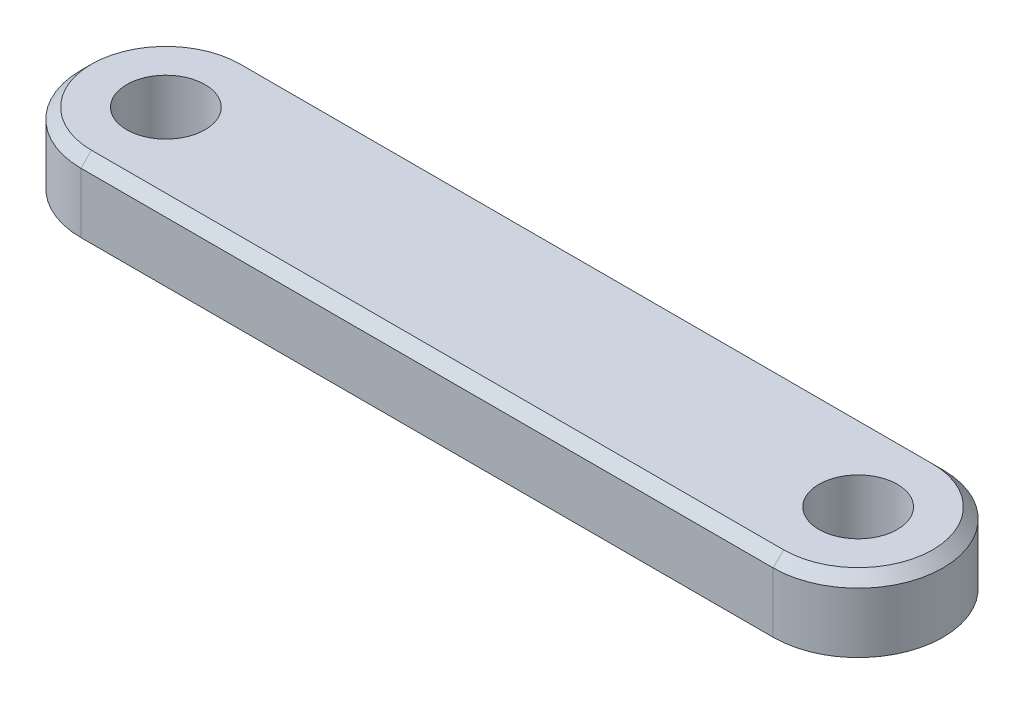
ISO-10303-21;
HEADER;
FILE_DESCRIPTION(('STEP AP214'),'2;1');
FILE_NAME('part.step','',(''),(''),'','','');
FILE_SCHEMA(('AUTOMOTIVE_DESIGN { 1 0 10303 214 1 1 1 1 }'));
ENDSEC;
DATA;
#1=APPLICATION_CONTEXT('core data for automotive mechanical design processes');
#2=APPLICATION_PROTOCOL_DEFINITION('international standard','automotive_design',2000,#1);
#3=PRODUCT_CONTEXT('',#1,'mechanical');
#4=PRODUCT('Part','Part','',(#3));
#5=PRODUCT_RELATED_PRODUCT_CATEGORY('part','',(#4));
#6=PRODUCT_DEFINITION_FORMATION('','',#4);
#7=PRODUCT_DEFINITION_CONTEXT('part definition',#1,'design');
#8=PRODUCT_DEFINITION('design','',#6,#7);
#9=PRODUCT_DEFINITION_SHAPE('','',#8);
#10=(LENGTH_UNIT() NAMED_UNIT(*) SI_UNIT(.MILLI.,.METRE.));
#11=(NAMED_UNIT(*) PLANE_ANGLE_UNIT() SI_UNIT($,.RADIAN.));
#12=(NAMED_UNIT(*) SI_UNIT($,.STERADIAN.) SOLID_ANGLE_UNIT());
#13=UNCERTAINTY_MEASURE_WITH_UNIT(LENGTH_MEASURE(1.E-05),#10,'distance_accuracy_value','');
#14=(GEOMETRIC_REPRESENTATION_CONTEXT(3) GLOBAL_UNCERTAINTY_ASSIGNED_CONTEXT((#13)) GLOBAL_UNIT_ASSIGNED_CONTEXT((#10,
#11,#12)) REPRESENTATION_CONTEXT('',''));
#15=CARTESIAN_POINT('',(0.,0.,0.));
#16=DIRECTION('',(0.,0.,1.));
#17=DIRECTION('',(1.,0.,0.));
#18=AXIS2_PLACEMENT_3D('',#15,#16,#17);
#19=CARTESIAN_POINT('',(-13.25,1.35,0.));
#20=DIRECTION('',(0.,1.,0.));
#21=DIRECTION('',(0.,0.,1.));
#22=AXIS2_PLACEMENT_3D('',#19,#20,#21);
#23=PLANE('',#22);
#24=DIRECTION('',(1.,0.,0.));
#25=VECTOR('',#24,1.);
#26=CARTESIAN_POINT('',(13.25,1.35,2.85));
#27=LINE('',#26,#25);
#28=CARTESIAN_POINT('',(-13.25,1.35,2.85));
#29=VERTEX_POINT('',#28);
#30=CARTESIAN_POINT('',(13.25,1.35,2.85));
#31=VERTEX_POINT('',#30);
#32=EDGE_CURVE('E105',#29,#31,#27,.T.);
#33=ORIENTED_EDGE('',*,*,#32,.T.);
#34=CARTESIAN_POINT('',(13.25,1.35,0.));
#35=DIRECTION('',(0.,1.,0.));
#36=DIRECTION('',(0.,0.,1.));
#37=AXIS2_PLACEMENT_3D('',#34,#35,#36);
#38=CIRCLE('',#37,2.85);
#39=CARTESIAN_POINT('',(13.25,1.35,-2.85));
#40=VERTEX_POINT('',#39);
#41=EDGE_CURVE('E150',#31,#40,#38,.T.);
#42=ORIENTED_EDGE('',*,*,#41,.T.);
#43=DIRECTION('',(-1.,0.,0.));
#44=VECTOR('',#43,1.);
#45=CARTESIAN_POINT('',(-13.25,1.35,-2.85));
#46=LINE('',#45,#44);
#47=CARTESIAN_POINT('',(-13.25,1.35,-2.85));
#48=VERTEX_POINT('',#47);
#49=EDGE_CURVE('E147',#40,#48,#46,.T.);
#50=ORIENTED_EDGE('',*,*,#49,.T.);
#51=CARTESIAN_POINT('',(-13.25,1.35,0.));
#52=DIRECTION('',(0.,1.,0.));
#53=DIRECTION('',(0.,0.,1.));
#54=AXIS2_PLACEMENT_3D('',#51,#52,#53);
#55=CIRCLE('',#54,2.85);
#56=EDGE_CURVE('E144',#48,#29,#55,.T.);
#57=ORIENTED_EDGE('',*,*,#56,.T.);
#58=EDGE_LOOP('',(#33,#42,#50,#57));
#59=FACE_BOUND('',#58,.T.);
#60=CARTESIAN_POINT('',(-13.25,1.35,0.));
#61=DIRECTION('',(0.,1.,0.));
#62=DIRECTION('',(0.,0.,1.));
#63=AXIS2_PLACEMENT_3D('',#60,#61,#62);
#64=CIRCLE('',#63,1.5);
#65=CARTESIAN_POINT('',(-13.25,1.35,1.50000000000001));
#66=VERTEX_POINT('',#65);
#67=EDGE_CURVE('E122',#66,#66,#64,.T.);
#68=ORIENTED_EDGE('',*,*,#67,.F.);
#69=EDGE_LOOP('',(#68));
#70=FACE_BOUND('',#69,.T.);
#71=CARTESIAN_POINT('',(13.25,1.35,0.));
#72=DIRECTION('',(0.,1.,0.));
#73=DIRECTION('',(0.,0.,-1.));
#74=AXIS2_PLACEMENT_3D('',#71,#72,#73);
#75=CIRCLE('',#74,1.5);
#76=CARTESIAN_POINT('',(13.25,1.35,-1.5));
#77=VERTEX_POINT('',#76);
#78=EDGE_CURVE('E183',#77,#77,#75,.T.);
#79=ORIENTED_EDGE('',*,*,#78,.F.);
#80=EDGE_LOOP('',(#79));
#81=FACE_BOUND('',#80,.T.);
#82=ADVANCED_FACE('F45',(#59,#70,#81),#23,.T.);
#83=CARTESIAN_POINT('',(-13.25,-1.35,0.));
#84=DIRECTION('',(0.,1.,0.));
#85=DIRECTION('',(0.,0.,1.));
#86=AXIS2_PLACEMENT_3D('',#83,#84,#85);
#87=PLANE('',#86);
#88=CARTESIAN_POINT('',(-13.25,-1.35,0.));
#89=DIRECTION('',(0.,1.,0.));
#90=DIRECTION('',(0.,0.,1.));
#91=AXIS2_PLACEMENT_3D('',#88,#89,#90);
#92=CIRCLE('',#91,3.25);
#93=CARTESIAN_POINT('',(-13.25,-1.35,-3.25));
#94=VERTEX_POINT('',#93);
#95=CARTESIAN_POINT('',(-13.25,-1.35,3.25));
#96=VERTEX_POINT('',#95);
#97=EDGE_CURVE('E113',#94,#96,#92,.T.);
#98=ORIENTED_EDGE('',*,*,#97,.F.);
#99=DIRECTION('',(-1.,0.,0.));
#100=VECTOR('',#99,1.);
#101=CARTESIAN_POINT('',(-13.25,-1.35,-3.25));
#102=LINE('',#101,#100);
#103=CARTESIAN_POINT('',(13.25,-1.35,-3.25000000000001));
#104=VERTEX_POINT('',#103);
#105=EDGE_CURVE('E132',#104,#94,#102,.T.);
#106=ORIENTED_EDGE('',*,*,#105,.F.);
#107=CARTESIAN_POINT('',(13.25,-1.35,0.));
#108=DIRECTION('',(0.,1.,0.));
#109=DIRECTION('',(0.,0.,1.));
#110=AXIS2_PLACEMENT_3D('',#107,#108,#109);
#111=CIRCLE('',#110,3.25);
#112=CARTESIAN_POINT('',(13.25,-1.35,3.25));
#113=VERTEX_POINT('',#112);
#114=EDGE_CURVE('E115',#113,#104,#111,.T.);
#115=ORIENTED_EDGE('',*,*,#114,.F.);
#116=DIRECTION('',(1.,0.,0.));
#117=VECTOR('',#116,1.);
#118=CARTESIAN_POINT('',(-13.25,-1.35,3.25));
#119=LINE('',#118,#117);
#120=EDGE_CURVE('E101',#96,#113,#119,.T.);
#121=ORIENTED_EDGE('',*,*,#120,.F.);
#122=EDGE_LOOP('',(#98,#106,#115,#121));
#123=FACE_BOUND('',#122,.T.);
#124=CARTESIAN_POINT('',(-13.25,-1.35,0.));
#125=DIRECTION('',(0.,1.,0.));
#126=DIRECTION('',(0.,0.,1.));
#127=AXIS2_PLACEMENT_3D('',#124,#125,#126);
#128=CIRCLE('',#127,1.5);
#129=CARTESIAN_POINT('',(-13.25,-1.35,1.50000000000001));
#130=VERTEX_POINT('',#129);
#131=EDGE_CURVE('E126',#130,#130,#128,.T.);
#132=ORIENTED_EDGE('',*,*,#131,.T.);
#133=EDGE_LOOP('',(#132));
#134=FACE_BOUND('',#133,.T.);
#135=CARTESIAN_POINT('',(13.25,-1.35,0.));
#136=DIRECTION('',(0.,1.,0.));
#137=DIRECTION('',(0.,0.,-1.));
#138=AXIS2_PLACEMENT_3D('',#135,#136,#137);
#139=CIRCLE('',#138,1.5);
#140=CARTESIAN_POINT('',(13.25,-1.35,-1.5));
#141=VERTEX_POINT('',#140);
#142=EDGE_CURVE('E177',#141,#141,#139,.T.);
#143=ORIENTED_EDGE('',*,*,#142,.T.);
#144=EDGE_LOOP('',(#143));
#145=FACE_BOUND('',#144,.T.);
#146=ADVANCED_FACE('F110',(#123,#134,#145),#87,.F.);
#147=CARTESIAN_POINT('',(-13.25,1.35,0.));
#148=DIRECTION('',(0.,-1.,0.));
#149=DIRECTION('',(0.,0.,-1.));
#150=AXIS2_PLACEMENT_3D('',#147,#148,#149);
#151=CYLINDRICAL_SURFACE('',#150,3.25);
#152=DIRECTION('',(0.,-1.,0.));
#153=VECTOR('',#152,1.);
#154=CARTESIAN_POINT('',(-13.25,1.35,3.25));
#155=LINE('',#154,#153);
#156=CARTESIAN_POINT('',(-13.25,0.949999999999996,3.25));
#157=VERTEX_POINT('',#156);
#158=EDGE_CURVE('E98',#157,#96,#155,.T.);
#159=ORIENTED_EDGE('',*,*,#158,.F.);
#160=CARTESIAN_POINT('',(-13.25,0.949999999999996,0.));
#161=DIRECTION('',(0.,1.,0.));
#162=DIRECTION('',(0.,0.,1.));
#163=AXIS2_PLACEMENT_3D('',#160,#161,#162);
#164=CIRCLE('',#163,3.25);
#165=CARTESIAN_POINT('',(-13.25,0.949999999999996,-3.25));
#166=VERTEX_POINT('',#165);
#167=EDGE_CURVE('E56',#157,#166,#164,.F.);
#168=ORIENTED_EDGE('',*,*,#167,.T.);
#169=DIRECTION('',(0.,-1.,0.));
#170=VECTOR('',#169,1.);
#171=CARTESIAN_POINT('',(-13.25,1.35,-3.25));
#172=LINE('',#171,#170);
#173=EDGE_CURVE('E119',#166,#94,#172,.T.);
#174=ORIENTED_EDGE('',*,*,#173,.T.);
#175=ORIENTED_EDGE('',*,*,#97,.T.);
#176=EDGE_LOOP('',(#159,#168,#174,#175));
#177=FACE_BOUND('',#176,.T.);
#178=ADVANCED_FACE('F118',(#177),#151,.T.);
#179=CARTESIAN_POINT('',(-13.25,1.35,3.25));
#180=DIRECTION('',(0.,0.,-1.));
#181=DIRECTION('',(-1.,0.,0.));
#182=AXIS2_PLACEMENT_3D('',#179,#180,#181);
#183=PLANE('',#182);
#184=DIRECTION('',(0.,-1.,0.));
#185=VECTOR('',#184,1.);
#186=CARTESIAN_POINT('',(13.25,1.35,3.25));
#187=LINE('',#186,#185);
#188=CARTESIAN_POINT('',(13.25,0.949999999999996,3.25));
#189=VERTEX_POINT('',#188);
#190=EDGE_CURVE('E106',#189,#113,#187,.T.);
#191=ORIENTED_EDGE('',*,*,#190,.F.);
#192=DIRECTION('',(-1.,0.,0.));
#193=VECTOR('',#192,1.);
#194=CARTESIAN_POINT('',(-13.25,0.949999999999996,3.25));
#195=LINE('',#194,#193);
#196=EDGE_CURVE('E11',#189,#157,#195,.T.);
#197=ORIENTED_EDGE('',*,*,#196,.T.);
#198=ORIENTED_EDGE('',*,*,#158,.T.);
#199=ORIENTED_EDGE('',*,*,#120,.T.);
#200=EDGE_LOOP('',(#191,#197,#198,#199));
#201=FACE_BOUND('',#200,.T.);
#202=ADVANCED_FACE('F100',(#201),#183,.F.);
#203=CARTESIAN_POINT('',(13.25,1.35,0.));
#204=DIRECTION('',(0.,-1.,0.));
#205=DIRECTION('',(0.,0.,-1.));
#206=AXIS2_PLACEMENT_3D('',#203,#204,#205);
#207=CYLINDRICAL_SURFACE('',#206,3.25);
#208=DIRECTION('',(0.,-1.,0.));
#209=VECTOR('',#208,1.);
#210=CARTESIAN_POINT('',(13.25,1.35,-3.25000000000001));
#211=LINE('',#210,#209);
#212=CARTESIAN_POINT('',(13.25,0.949999999999996,-3.25000000000001));
#213=VERTEX_POINT('',#212);
#214=EDGE_CURVE('E137',#213,#104,#211,.T.);
#215=ORIENTED_EDGE('',*,*,#214,.F.);
#216=CARTESIAN_POINT('',(13.25,0.949999999999996,0.));
#217=DIRECTION('',(0.,1.,0.));
#218=DIRECTION('',(0.,0.,1.));
#219=AXIS2_PLACEMENT_3D('',#216,#217,#218);
#220=CIRCLE('',#219,3.25);
#221=EDGE_CURVE('E154',#213,#189,#220,.F.);
#222=ORIENTED_EDGE('',*,*,#221,.T.);
#223=ORIENTED_EDGE('',*,*,#190,.T.);
#224=ORIENTED_EDGE('',*,*,#114,.T.);
#225=EDGE_LOOP('',(#215,#222,#223,#224));
#226=FACE_BOUND('',#225,.T.);
#227=ADVANCED_FACE('F207',(#226),#207,.T.);
#228=CARTESIAN_POINT('',(-13.25,1.35,-3.25));
#229=DIRECTION('',(0.,0.,1.));
#230=DIRECTION('',(1.,0.,0.));
#231=AXIS2_PLACEMENT_3D('',#228,#229,#230);
#232=PLANE('',#231);
#233=ORIENTED_EDGE('',*,*,#173,.F.);
#234=DIRECTION('',(1.,0.,0.));
#235=VECTOR('',#234,1.);
#236=CARTESIAN_POINT('',(13.25,0.949999999999996,-3.25000000000001));
#237=LINE('',#236,#235);
#238=EDGE_CURVE('E158',#166,#213,#237,.T.);
#239=ORIENTED_EDGE('',*,*,#238,.T.);
#240=ORIENTED_EDGE('',*,*,#214,.T.);
#241=ORIENTED_EDGE('',*,*,#105,.T.);
#242=EDGE_LOOP('',(#233,#239,#240,#241));
#243=FACE_BOUND('',#242,.T.);
#244=ADVANCED_FACE('F199',(#243),#232,.F.);
#245=CARTESIAN_POINT('',(-13.25,1.35,0.));
#246=DIRECTION('',(0.,-1.,0.));
#247=DIRECTION('',(0.,0.,-1.));
#248=AXIS2_PLACEMENT_3D('',#245,#246,#247);
#249=CYLINDRICAL_SURFACE('',#248,1.5);
#250=ORIENTED_EDGE('',*,*,#67,.T.);
#251=EDGE_LOOP('',(#250));
#252=FACE_BOUND('',#251,.T.);
#253=ORIENTED_EDGE('',*,*,#131,.F.);
#254=EDGE_LOOP('',(#253));
#255=FACE_BOUND('',#254,.T.);
#256=ADVANCED_FACE('F196',(#252,#255),#249,.F.);
#257=CARTESIAN_POINT('',(13.25,1.35,0.));
#258=DIRECTION('',(0.,-1.,0.));
#259=DIRECTION('',(0.,0.,-1.));
#260=AXIS2_PLACEMENT_3D('',#257,#258,#259);
#261=CYLINDRICAL_SURFACE('',#260,1.5);
#262=ORIENTED_EDGE('',*,*,#78,.T.);
#263=EDGE_LOOP('',(#262));
#264=FACE_BOUND('',#263,.T.);
#265=ORIENTED_EDGE('',*,*,#142,.F.);
#266=EDGE_LOOP('',(#265));
#267=FACE_BOUND('',#266,.T.);
#268=ADVANCED_FACE('F198',(#264,#267),#261,.F.);
#269=CARTESIAN_POINT('',(-13.25,1.35,0.));
#270=DIRECTION('',(0.,-1.,0.));
#271=DIRECTION('',(0.,0.,-1.));
#272=AXIS2_PLACEMENT_3D('',#269,#270,#271);
#273=CONICAL_SURFACE('',#272,2.85,0.785398163397448);
#274=DIRECTION('',(0.,0.707106781186547,0.707106781186547));
#275=VECTOR('',#274,1.);
#276=CARTESIAN_POINT('',(-13.25,0.949999999999996,-3.25));
#277=LINE('',#276,#275);
#278=EDGE_CURVE('E168',#166,#48,#277,.T.);
#279=ORIENTED_EDGE('',*,*,#278,.F.);
#280=ORIENTED_EDGE('',*,*,#167,.F.);
#281=DIRECTION('',(0.,-0.707106781186547,0.707106781186547));
#282=VECTOR('',#281,1.);
#283=CARTESIAN_POINT('',(-13.25,1.35,2.85000000000001));
#284=LINE('',#283,#282);
#285=EDGE_CURVE('E50',#29,#157,#284,.T.);
#286=ORIENTED_EDGE('',*,*,#285,.F.);
#287=ORIENTED_EDGE('',*,*,#56,.F.);
#288=EDGE_LOOP('',(#279,#280,#286,#287));
#289=FACE_BOUND('',#288,.T.);
#290=ADVANCED_FACE('F48',(#289),#273,.T.);
#291=CARTESIAN_POINT('',(-13.25,1.35,2.85));
#292=DIRECTION('',(0.,0.707106781186547,0.707106781186547));
#293=DIRECTION('',(-1.,0.,0.));
#294=AXIS2_PLACEMENT_3D('',#291,#292,#293);
#295=PLANE('',#294);
#296=ORIENTED_EDGE('',*,*,#285,.T.);
#297=ORIENTED_EDGE('',*,*,#196,.F.);
#298=DIRECTION('',(0.,-0.707106781186547,0.707106781186547));
#299=VECTOR('',#298,1.);
#300=CARTESIAN_POINT('',(13.25,1.35,2.85));
#301=LINE('',#300,#299);
#302=EDGE_CURVE('E166',#31,#189,#301,.T.);
#303=ORIENTED_EDGE('',*,*,#302,.F.);
#304=ORIENTED_EDGE('',*,*,#32,.F.);
#305=EDGE_LOOP('',(#296,#297,#303,#304));
#306=FACE_BOUND('',#305,.T.);
#307=ADVANCED_FACE('F239',(#306),#295,.T.);
#308=CARTESIAN_POINT('',(-13.25,1.35,-2.85));
#309=DIRECTION('',(0.,0.707106781186547,-0.707106781186547));
#310=DIRECTION('',(1.,0.,0.));
#311=AXIS2_PLACEMENT_3D('',#308,#309,#310);
#312=PLANE('',#311);
#313=ORIENTED_EDGE('',*,*,#278,.T.);
#314=ORIENTED_EDGE('',*,*,#49,.F.);
#315=DIRECTION('',(0.,0.707106781186547,0.707106781186547));
#316=VECTOR('',#315,1.);
#317=CARTESIAN_POINT('',(13.25,0.949999999999996,-3.25000000000001));
#318=LINE('',#317,#316);
#319=EDGE_CURVE('E163',#213,#40,#318,.T.);
#320=ORIENTED_EDGE('',*,*,#319,.F.);
#321=ORIENTED_EDGE('',*,*,#238,.F.);
#322=EDGE_LOOP('',(#313,#314,#320,#321));
#323=FACE_BOUND('',#322,.T.);
#324=ADVANCED_FACE('F233',(#323),#312,.T.);
#325=CARTESIAN_POINT('',(13.25,1.35,0.));
#326=DIRECTION('',(0.,-1.,0.));
#327=DIRECTION('',(0.,0.,-1.));
#328=AXIS2_PLACEMENT_3D('',#325,#326,#327);
#329=CONICAL_SURFACE('',#328,2.85,0.785398163397448);
#330=ORIENTED_EDGE('',*,*,#302,.T.);
#331=ORIENTED_EDGE('',*,*,#221,.F.);
#332=ORIENTED_EDGE('',*,*,#319,.T.);
#333=ORIENTED_EDGE('',*,*,#41,.F.);
#334=EDGE_LOOP('',(#330,#331,#332,#333));
#335=FACE_BOUND('',#334,.T.);
#336=ADVANCED_FACE('F227',(#335),#329,.T.);
#337=CLOSED_SHELL('',(#82,#146,#178,#202,#227,#244,#256,#268,#290,#307,#324,#336));
#338=MANIFOLD_SOLID_BREP('B2',#337);
#339=ADVANCED_BREP_SHAPE_REPRESENTATION('',(#18,#338),#14);
#340=SHAPE_DEFINITION_REPRESENTATION(#9,#339);
ENDSEC;
END-ISO-10303-21;
